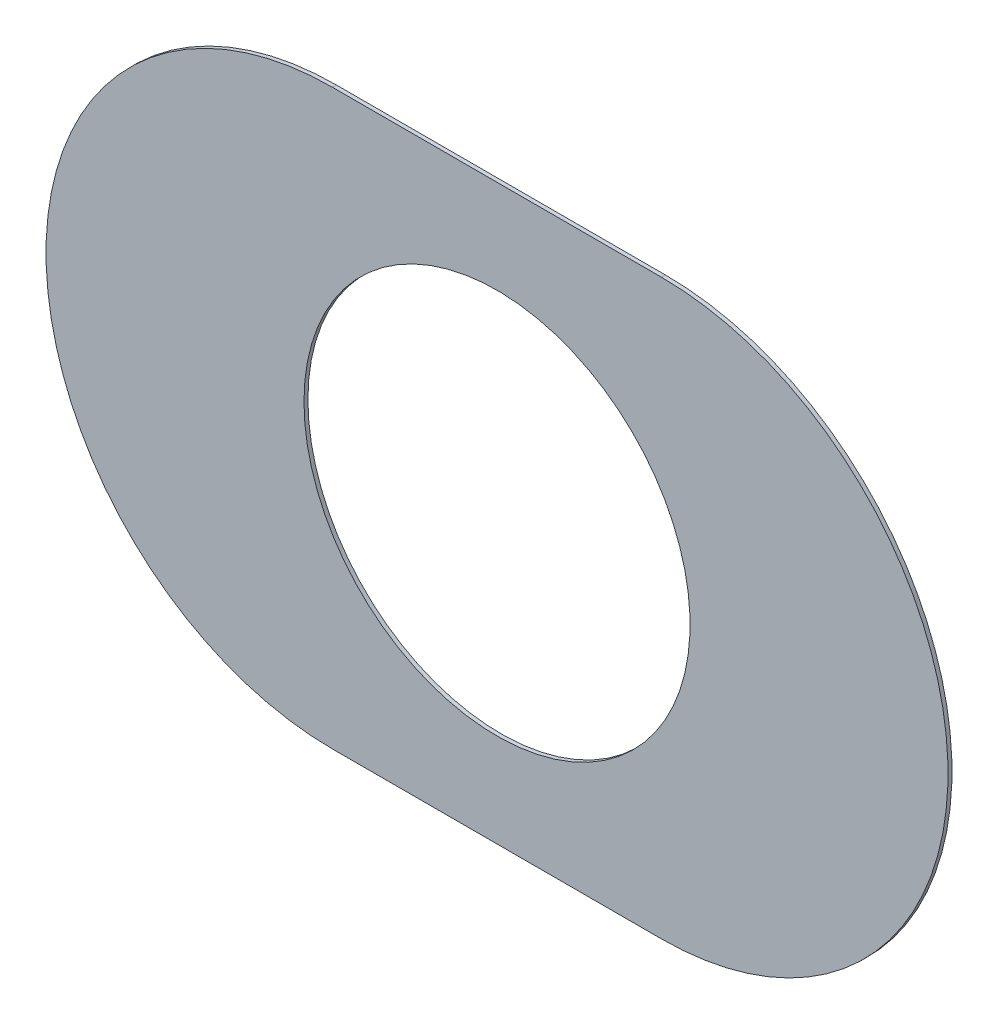
ISO-10303-21;
HEADER;
FILE_DESCRIPTION(('STEP AP214'),'2;1');
FILE_NAME('part.step','',(''),(''),'','','');
FILE_SCHEMA(('AUTOMOTIVE_DESIGN { 1 0 10303 214 1 1 1 1 }'));
ENDSEC;
DATA;
#1=APPLICATION_CONTEXT('core data for automotive mechanical design processes');
#2=APPLICATION_PROTOCOL_DEFINITION('international standard','automotive_design',2000,#1);
#3=PRODUCT_CONTEXT('',#1,'mechanical');
#4=PRODUCT('Part','Part','',(#3));
#5=PRODUCT_RELATED_PRODUCT_CATEGORY('part','',(#4));
#6=PRODUCT_DEFINITION_FORMATION('','',#4);
#7=PRODUCT_DEFINITION_CONTEXT('part definition',#1,'design');
#8=PRODUCT_DEFINITION('design','',#6,#7);
#9=PRODUCT_DEFINITION_SHAPE('','',#8);
#10=(LENGTH_UNIT() NAMED_UNIT(*) SI_UNIT(.MILLI.,.METRE.));
#11=(NAMED_UNIT(*) PLANE_ANGLE_UNIT() SI_UNIT($,.RADIAN.));
#12=(NAMED_UNIT(*) SI_UNIT($,.STERADIAN.) SOLID_ANGLE_UNIT());
#13=UNCERTAINTY_MEASURE_WITH_UNIT(LENGTH_MEASURE(1.E-05),#10,'distance_accuracy_value','');
#14=(GEOMETRIC_REPRESENTATION_CONTEXT(3) GLOBAL_UNCERTAINTY_ASSIGNED_CONTEXT((#13)) GLOBAL_UNIT_ASSIGNED_CONTEXT((#10,
#11,#12)) REPRESENTATION_CONTEXT('',''));
#15=CARTESIAN_POINT('',(0.,0.,0.));
#16=DIRECTION('',(0.,0.,1.));
#17=DIRECTION('',(1.,0.,0.));
#18=AXIS2_PLACEMENT_3D('',#15,#16,#17);
#19=CARTESIAN_POINT('',(1.54999965727325,39.9400006854535,0.));
#20=DIRECTION('',(0.,0.,-1.));
#21=DIRECTION('',(0.,-1.,0.));
#22=AXIS2_PLACEMENT_3D('',#19,#20,#21);
#23=PLANE('',#22);
#24=CARTESIAN_POINT('',(1.54999965727325,39.9400006854535,0.));
#25=DIRECTION('',(0.,0.,1.));
#26=DIRECTION('',(1.,0.,0.));
#27=AXIS2_PLACEMENT_3D('',#24,#25,#26);
#28=CIRCLE('',#27,0.49);
#29=CARTESIAN_POINT('',(1.05999965727325,39.9400006854535,0.));
#30=VERTEX_POINT('',#29);
#31=EDGE_CURVE('E58',#30,#30,#28,.T.);
#32=ORIENTED_EDGE('',*,*,#31,.F.);
#33=EDGE_LOOP('',(#32));
#34=FACE_BOUND('',#33,.T.);
#35=CARTESIAN_POINT('',(1.96740611181985,39.9400006854535,0.));
#36=DIRECTION('',(0.,0.,-1.));
#37=DIRECTION('',(0.,1.,0.));
#38=AXIS2_PLACEMENT_3D('',#35,#36,#37);
#39=CIRCLE('',#38,0.727257121659981);
#40=CARTESIAN_POINT('',(1.96740611181985,40.6672578071135,0.));
#41=VERTEX_POINT('',#40);
#42=CARTESIAN_POINT('',(1.96740611181985,39.2127435637935,0.));
#43=VERTEX_POINT('',#42);
#44=EDGE_CURVE('E28',#41,#43,#39,.T.);
#45=ORIENTED_EDGE('',*,*,#44,.F.);
#46=DIRECTION('',(1.,0.,0.));
#47=VECTOR('',#46,1.);
#48=CARTESIAN_POINT('',(1.13259320272665,40.6672578071135,0.));
#49=LINE('',#48,#47);
#50=CARTESIAN_POINT('',(1.13259320272665,40.6672578071135,0.));
#51=VERTEX_POINT('',#50);
#52=EDGE_CURVE('E117',#51,#41,#49,.T.);
#53=ORIENTED_EDGE('',*,*,#52,.F.);
#54=CARTESIAN_POINT('',(1.13259320272665,39.9400006854535,0.));
#55=DIRECTION('',(0.,0.,-1.));
#56=DIRECTION('',(0.,-1.,0.));
#57=AXIS2_PLACEMENT_3D('',#54,#55,#56);
#58=CIRCLE('',#57,0.727257121659981);
#59=CARTESIAN_POINT('',(1.13259320272665,39.2127435637935,0.));
#60=VERTEX_POINT('',#59);
#61=EDGE_CURVE('E99',#60,#51,#58,.T.);
#62=ORIENTED_EDGE('',*,*,#61,.F.);
#63=DIRECTION('',(-1.,0.,0.));
#64=VECTOR('',#63,1.);
#65=CARTESIAN_POINT('',(1.96740611181985,39.2127435637935,0.));
#66=LINE('',#65,#64);
#67=EDGE_CURVE('E82',#43,#60,#66,.T.);
#68=ORIENTED_EDGE('',*,*,#67,.F.);
#69=EDGE_LOOP('',(#45,#53,#62,#68));
#70=FACE_BOUND('',#69,.T.);
#71=ADVANCED_FACE('F17',(#34,#70),#23,.F.);
#72=CARTESIAN_POINT('',(1.54999965727325,39.9400006854535,-0.01));
#73=DIRECTION('',(0.,0.,-1.));
#74=DIRECTION('',(0.,-1.,0.));
#75=AXIS2_PLACEMENT_3D('',#72,#73,#74);
#76=PLANE('',#75);
#77=CARTESIAN_POINT('',(1.54999965727325,39.9400006854535,-0.01));
#78=DIRECTION('',(0.,0.,1.));
#79=DIRECTION('',(1.,0.,0.));
#80=AXIS2_PLACEMENT_3D('',#77,#78,#79);
#81=CIRCLE('',#80,0.49);
#82=CARTESIAN_POINT('',(1.05999965727325,39.9400006854535,-0.01));
#83=VERTEX_POINT('',#82);
#84=EDGE_CURVE('E121',#83,#83,#81,.T.);
#85=ORIENTED_EDGE('',*,*,#84,.T.);
#86=EDGE_LOOP('',(#85));
#87=FACE_BOUND('',#86,.T.);
#88=CARTESIAN_POINT('',(1.96740611181985,39.9400006854535,-0.01));
#89=DIRECTION('',(0.,0.,-1.));
#90=DIRECTION('',(0.,1.,0.));
#91=AXIS2_PLACEMENT_3D('',#88,#89,#90);
#92=CIRCLE('',#91,0.727257121659981);
#93=CARTESIAN_POINT('',(1.96740611181985,40.6672578071135,-0.01));
#94=VERTEX_POINT('',#93);
#95=CARTESIAN_POINT('',(1.96740611181985,39.2127435637935,-0.01));
#96=VERTEX_POINT('',#95);
#97=EDGE_CURVE('E11',#94,#96,#92,.T.);
#98=ORIENTED_EDGE('',*,*,#97,.T.);
#99=DIRECTION('',(-1.,0.,0.));
#100=VECTOR('',#99,1.);
#101=CARTESIAN_POINT('',(1.96740611181985,39.2127435637935,-0.01));
#102=LINE('',#101,#100);
#103=CARTESIAN_POINT('',(1.13259320272665,39.2127435637935,-0.01));
#104=VERTEX_POINT('',#103);
#105=EDGE_CURVE('E95',#96,#104,#102,.T.);
#106=ORIENTED_EDGE('',*,*,#105,.T.);
#107=CARTESIAN_POINT('',(1.13259320272665,39.9400006854535,-0.01));
#108=DIRECTION('',(0.,0.,-1.));
#109=DIRECTION('',(0.,-1.,0.));
#110=AXIS2_PLACEMENT_3D('',#107,#108,#109);
#111=CIRCLE('',#110,0.727257121659981);
#112=CARTESIAN_POINT('',(1.13259320272665,40.6672578071135,-0.01));
#113=VERTEX_POINT('',#112);
#114=EDGE_CURVE('E88',#104,#113,#111,.T.);
#115=ORIENTED_EDGE('',*,*,#114,.T.);
#116=DIRECTION('',(1.,0.,0.));
#117=VECTOR('',#116,1.);
#118=CARTESIAN_POINT('',(1.13259320272665,40.6672578071135,-0.01));
#119=LINE('',#118,#117);
#120=EDGE_CURVE('E92',#113,#94,#119,.T.);
#121=ORIENTED_EDGE('',*,*,#120,.T.);
#122=EDGE_LOOP('',(#98,#106,#115,#121));
#123=FACE_BOUND('',#122,.T.);
#124=ADVANCED_FACE('F90',(#87,#123),#76,.T.);
#125=CARTESIAN_POINT('',(1.96740611181985,39.9400006854535,0.));
#126=DIRECTION('',(0.,0.,-1.));
#127=DIRECTION('',(0.,1.,0.));
#128=AXIS2_PLACEMENT_3D('',#125,#126,#127);
#129=CYLINDRICAL_SURFACE('',#128,0.727257121659981);
#130=ORIENTED_EDGE('',*,*,#44,.T.);
#131=DIRECTION('',(0.,0.,-1.));
#132=VECTOR('',#131,1.);
#133=CARTESIAN_POINT('',(1.96740611181985,39.2127435637935,0.));
#134=LINE('',#133,#132);
#135=EDGE_CURVE('E126',#43,#96,#134,.T.);
#136=ORIENTED_EDGE('',*,*,#135,.T.);
#137=ORIENTED_EDGE('',*,*,#97,.F.);
#138=DIRECTION('',(0.,0.,-1.));
#139=VECTOR('',#138,1.);
#140=CARTESIAN_POINT('',(1.96740611181985,40.6672578071135,0.));
#141=LINE('',#140,#139);
#142=EDGE_CURVE('E111',#41,#94,#141,.T.);
#143=ORIENTED_EDGE('',*,*,#142,.F.);
#144=EDGE_LOOP('',(#130,#136,#137,#143));
#145=FACE_BOUND('',#144,.T.);
#146=ADVANCED_FACE('F144',(#145),#129,.T.);
#147=CARTESIAN_POINT('',(1.96740611181985,39.2127435637935,0.));
#148=DIRECTION('',(0.,-1.,0.));
#149=DIRECTION('',(0.,0.,-1.));
#150=AXIS2_PLACEMENT_3D('',#147,#148,#149);
#151=PLANE('',#150);
#152=ORIENTED_EDGE('',*,*,#67,.T.);
#153=DIRECTION('',(0.,0.,-1.));
#154=VECTOR('',#153,1.);
#155=CARTESIAN_POINT('',(1.13259320272665,39.2127435637935,0.));
#156=LINE('',#155,#154);
#157=EDGE_CURVE('E98',#60,#104,#156,.T.);
#158=ORIENTED_EDGE('',*,*,#157,.T.);
#159=ORIENTED_EDGE('',*,*,#105,.F.);
#160=ORIENTED_EDGE('',*,*,#135,.F.);
#161=EDGE_LOOP('',(#152,#158,#159,#160));
#162=FACE_BOUND('',#161,.T.);
#163=ADVANCED_FACE('F151',(#162),#151,.T.);
#164=CARTESIAN_POINT('',(1.13259320272665,39.9400006854535,0.));
#165=DIRECTION('',(0.,0.,-1.));
#166=DIRECTION('',(0.,-1.,0.));
#167=AXIS2_PLACEMENT_3D('',#164,#165,#166);
#168=CYLINDRICAL_SURFACE('',#167,0.727257121659981);
#169=ORIENTED_EDGE('',*,*,#61,.T.);
#170=DIRECTION('',(0.,0.,-1.));
#171=VECTOR('',#170,1.);
#172=CARTESIAN_POINT('',(1.13259320272665,40.6672578071135,0.));
#173=LINE('',#172,#171);
#174=EDGE_CURVE('E102',#51,#113,#173,.T.);
#175=ORIENTED_EDGE('',*,*,#174,.T.);
#176=ORIENTED_EDGE('',*,*,#114,.F.);
#177=ORIENTED_EDGE('',*,*,#157,.F.);
#178=EDGE_LOOP('',(#169,#175,#176,#177));
#179=FACE_BOUND('',#178,.T.);
#180=ADVANCED_FACE('F19',(#179),#168,.T.);
#181=CARTESIAN_POINT('',(1.13259320272665,40.6672578071135,0.));
#182=DIRECTION('',(0.,1.,0.));
#183=DIRECTION('',(1.,0.,0.));
#184=AXIS2_PLACEMENT_3D('',#181,#182,#183);
#185=PLANE('',#184);
#186=ORIENTED_EDGE('',*,*,#52,.T.);
#187=ORIENTED_EDGE('',*,*,#142,.T.);
#188=ORIENTED_EDGE('',*,*,#120,.F.);
#189=ORIENTED_EDGE('',*,*,#174,.F.);
#190=EDGE_LOOP('',(#186,#187,#188,#189));
#191=FACE_BOUND('',#190,.T.);
#192=ADVANCED_FACE('F109',(#191),#185,.T.);
#193=CARTESIAN_POINT('',(1.54999965727325,39.9400006854535,0.));
#194=DIRECTION('',(0.,0.,-1.));
#195=DIRECTION('',(1.,0.,0.));
#196=AXIS2_PLACEMENT_3D('',#193,#194,#195);
#197=CYLINDRICAL_SURFACE('',#196,0.49);
#198=ORIENTED_EDGE('',*,*,#84,.F.);
#199=DIRECTION('',(0.,0.,1.));
#200=VECTOR('',#199,1.);
#201=CARTESIAN_POINT('',(1.05999965727325,39.9400006854535,0.));
#202=LINE('',#201,#200);
#203=EDGE_CURVE('E21',#83,#30,#202,.T.);
#204=ORIENTED_EDGE('',*,*,#203,.T.);
#205=ORIENTED_EDGE('',*,*,#31,.T.);
#206=ORIENTED_EDGE('',*,*,#203,.F.);
#207=EDGE_LOOP('',(#198,#204,#205,#206));
#208=FACE_BOUND('',#207,.T.);
#209=ADVANCED_FACE('F141',(#208),#197,.F.);
#210=CLOSED_SHELL('',(#71,#124,#146,#163,#180,#192,#209));
#211=MANIFOLD_SOLID_BREP('B1',#210);
#212=ADVANCED_BREP_SHAPE_REPRESENTATION('',(#18,#211),#14);
#213=SHAPE_DEFINITION_REPRESENTATION(#9,#212);
ENDSEC;
END-ISO-10303-21;
